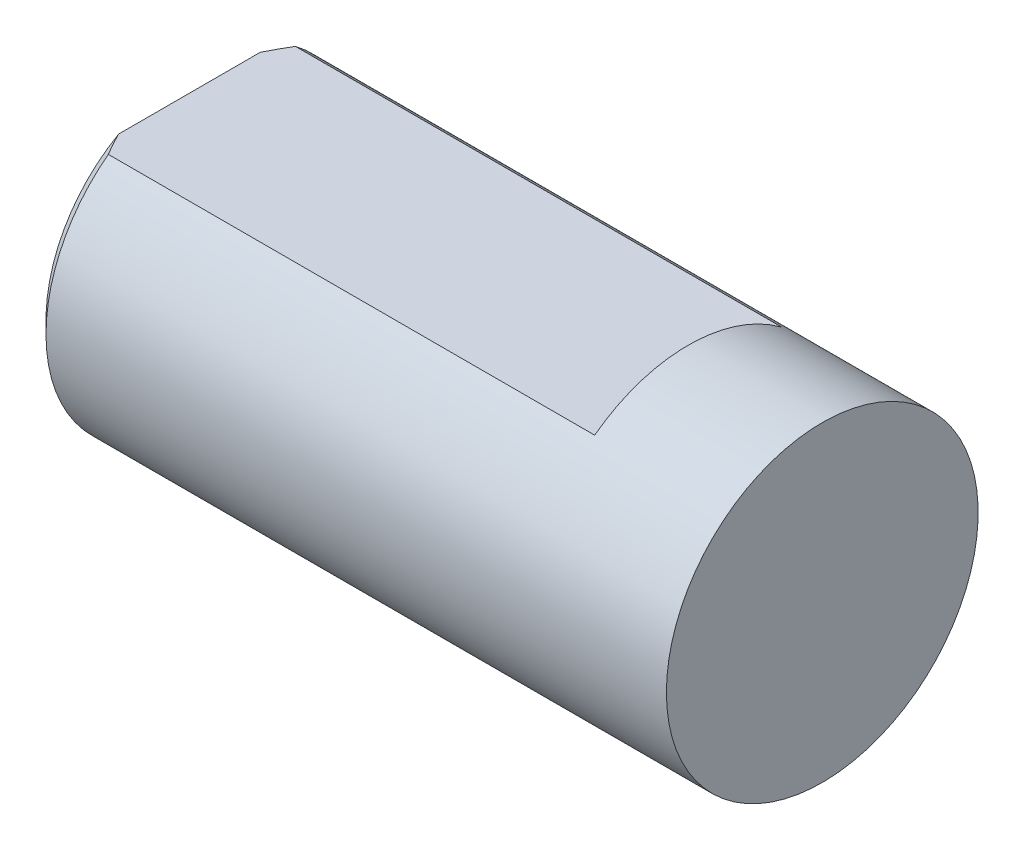
ISO-10303-21;
HEADER;
FILE_DESCRIPTION(('STEP AP214'),'2;1');
FILE_NAME('part.step','',(''),(''),'','','');
FILE_SCHEMA(('AUTOMOTIVE_DESIGN { 1 0 10303 214 1 1 1 1 }'));
ENDSEC;
DATA;
#1=APPLICATION_CONTEXT('core data for automotive mechanical design processes');
#2=APPLICATION_PROTOCOL_DEFINITION('international standard','automotive_design',2000,#1);
#3=PRODUCT_CONTEXT('',#1,'mechanical');
#4=PRODUCT('Part','Part','',(#3));
#5=PRODUCT_RELATED_PRODUCT_CATEGORY('part','',(#4));
#6=PRODUCT_DEFINITION_FORMATION('','',#4);
#7=PRODUCT_DEFINITION_CONTEXT('part definition',#1,'design');
#8=PRODUCT_DEFINITION('design','',#6,#7);
#9=PRODUCT_DEFINITION_SHAPE('','',#8);
#10=(LENGTH_UNIT() NAMED_UNIT(*) SI_UNIT(.MILLI.,.METRE.));
#11=(NAMED_UNIT(*) PLANE_ANGLE_UNIT() SI_UNIT($,.RADIAN.));
#12=(NAMED_UNIT(*) SI_UNIT($,.STERADIAN.) SOLID_ANGLE_UNIT());
#13=UNCERTAINTY_MEASURE_WITH_UNIT(LENGTH_MEASURE(1.E-05),#10,'distance_accuracy_value','');
#14=(GEOMETRIC_REPRESENTATION_CONTEXT(3) GLOBAL_UNCERTAINTY_ASSIGNED_CONTEXT((#13)) GLOBAL_UNIT_ASSIGNED_CONTEXT((#10,
#11,#12)) REPRESENTATION_CONTEXT('',''));
#15=CARTESIAN_POINT('',(0.,0.,0.));
#16=DIRECTION('',(0.,0.,1.));
#17=DIRECTION('',(1.,0.,0.));
#18=AXIS2_PLACEMENT_3D('',#15,#16,#17);
#19=CARTESIAN_POINT('',(0.,0.,0.));
#20=DIRECTION('',(-1.,0.,0.));
#21=DIRECTION('',(0.,0.,1.));
#22=AXIS2_PLACEMENT_3D('',#19,#20,#21);
#23=PLANE('',#22);
#24=CARTESIAN_POINT('',(0.,0.,0.));
#25=DIRECTION('',(-1.,0.,0.));
#26=DIRECTION('',(0.,0.,1.));
#27=AXIS2_PLACEMENT_3D('',#24,#25,#26);
#28=CIRCLE('',#27,2.5);
#29=CARTESIAN_POINT('',(0.,0.,2.5));
#30=VERTEX_POINT('',#29);
#31=EDGE_CURVE('E77',#30,#30,#28,.T.);
#32=ORIENTED_EDGE('',*,*,#31,.F.);
#33=EDGE_LOOP('',(#32));
#34=FACE_BOUND('',#33,.T.);
#35=ADVANCED_FACE('F31',(#34),#23,.F.);
#36=CARTESIAN_POINT('',(0.,0.,0.));
#37=DIRECTION('',(-1.,0.,0.));
#38=DIRECTION('',(0.,0.,1.));
#39=AXIS2_PLACEMENT_3D('',#36,#37,#38);
#40=CYLINDRICAL_SURFACE('',#39,2.5);
#41=DIRECTION('',(-1.,0.,0.));
#42=VECTOR('',#41,1.);
#43=CARTESIAN_POINT('',(-2.15,2.,1.5));
#44=LINE('',#43,#42);
#45=CARTESIAN_POINT('',(-2.15,2.,1.5));
#46=VERTEX_POINT('',#45);
#47=CARTESIAN_POINT('',(-9.95,2.,1.5));
#48=VERTEX_POINT('',#47);
#49=EDGE_CURVE('E66',#46,#48,#44,.T.);
#50=ORIENTED_EDGE('',*,*,#49,.T.);
#51=CARTESIAN_POINT('',(-9.95,0.,0.));
#52=DIRECTION('',(1.,0.,0.));
#53=DIRECTION('',(0.,0.,-1.));
#54=AXIS2_PLACEMENT_3D('',#51,#52,#53);
#55=CIRCLE('',#54,2.5);
#56=CARTESIAN_POINT('',(-9.95,2.,-1.5));
#57=VERTEX_POINT('',#56);
#58=EDGE_CURVE('E11',#48,#57,#55,.T.);
#59=ORIENTED_EDGE('',*,*,#58,.T.);
#60=DIRECTION('',(-1.,0.,0.));
#61=VECTOR('',#60,1.);
#62=CARTESIAN_POINT('',(-2.15,2.,-1.5));
#63=LINE('',#62,#61);
#64=CARTESIAN_POINT('',(-2.15,2.,-1.5));
#65=VERTEX_POINT('',#64);
#66=EDGE_CURVE('E64',#65,#57,#63,.T.);
#67=ORIENTED_EDGE('',*,*,#66,.F.);
#68=CARTESIAN_POINT('',(-2.15,0.,0.));
#69=DIRECTION('',(-1.,0.,0.));
#70=DIRECTION('',(0.,0.,1.));
#71=AXIS2_PLACEMENT_3D('',#68,#69,#70);
#72=CIRCLE('',#71,2.5);
#73=EDGE_CURVE('E69',#46,#65,#72,.T.);
#74=ORIENTED_EDGE('',*,*,#73,.F.);
#75=EDGE_LOOP('',(#50,#59,#67,#74));
#76=FACE_BOUND('',#75,.T.);
#77=ORIENTED_EDGE('',*,*,#31,.T.);
#78=EDGE_LOOP('',(#77));
#79=FACE_BOUND('',#78,.T.);
#80=ADVANCED_FACE('F74',(#76,#79),#40,.T.);
#81=CARTESIAN_POINT('',(-10.15,2.5,0.));
#82=DIRECTION('',(1.,0.,0.));
#83=DIRECTION('',(0.,0.,-1.));
#84=AXIS2_PLACEMENT_3D('',#81,#82,#83);
#85=PLANE('',#84);
#86=DIRECTION('',(0.,0.,1.));
#87=VECTOR('',#86,1.);
#88=CARTESIAN_POINT('',(-10.15,2.,0.));
#89=LINE('',#88,#87);
#90=CARTESIAN_POINT('',(-10.15,2.,-1.13578166916006));
#91=VERTEX_POINT('',#90);
#92=CARTESIAN_POINT('',(-10.15,2.,1.13578166916006));
#93=VERTEX_POINT('',#92);
#94=EDGE_CURVE('E72',#91,#93,#89,.T.);
#95=ORIENTED_EDGE('',*,*,#94,.F.);
#96=CARTESIAN_POINT('',(-10.15,0.,0.));
#97=DIRECTION('',(1.,0.,0.));
#98=DIRECTION('',(0.,0.,-1.));
#99=AXIS2_PLACEMENT_3D('',#96,#97,#98);
#100=CIRCLE('',#99,2.3);
#101=EDGE_CURVE('E82',#91,#93,#100,.F.);
#102=ORIENTED_EDGE('',*,*,#101,.T.);
#103=EDGE_LOOP('',(#95,#102));
#104=FACE_BOUND('',#103,.T.);
#105=ADVANCED_FACE('F100',(#104),#85,.F.);
#106=CARTESIAN_POINT('',(-2.15,2.,0.));
#107=DIRECTION('',(0.,-1.,0.));
#108=DIRECTION('',(0.,0.,-1.));
#109=AXIS2_PLACEMENT_3D('',#106,#107,#108);
#110=PLANE('',#109);
#111=ORIENTED_EDGE('',*,*,#94,.T.);
#112=CARTESIAN_POINT('',(-10.15,2.,1.13578166916006));
#113=CARTESIAN_POINT('',(-10.1346588897814,2.,1.16684531148886));
#114=CARTESIAN_POINT('',(-10.1189381376528,2.,1.19771947914308));
#115=CARTESIAN_POINT('',(-10.0868162971825,2.,1.25909582358931));
#116=CARTESIAN_POINT('',(-10.070415494086,2.,1.28959814953928));
#117=CARTESIAN_POINT('',(-10.0370005487157,2.,1.35026188212942));
#118=CARTESIAN_POINT('',(-10.0199864399502,2.,1.380423307277));
#119=CARTESIAN_POINT('',(-9.98539731601963,2.,1.44043971345171));
#120=CARTESIAN_POINT('',(-9.96782207083391,2.,1.47029456200406));
#121=CARTESIAN_POINT('',(-9.95,2.,1.5));
#122=B_SPLINE_CURVE_WITH_KNOTS('',3,(#112,#113,#114,#115,#116,#117,#118,#119,#120,#121),
.UNSPECIFIED.,.F.,.F.,(4,2,2,2,4),(0.,0.103930863284102,0.207818565532301,0.311700600383635,
0.415625779466399),.UNSPECIFIED.);
#123=EDGE_CURVE('E38',#93,#48,#122,.T.);
#124=ORIENTED_EDGE('',*,*,#123,.T.);
#125=ORIENTED_EDGE('',*,*,#49,.F.);
#126=DIRECTION('',(0.,0.,1.));
#127=VECTOR('',#126,1.);
#128=CARTESIAN_POINT('',(-2.15,2.,-1.5));
#129=LINE('',#128,#127);
#130=EDGE_CURVE('E61',#65,#46,#129,.T.);
#131=ORIENTED_EDGE('',*,*,#130,.F.);
#132=ORIENTED_EDGE('',*,*,#66,.T.);
#133=CARTESIAN_POINT('',(-9.95,2.,-1.5));
#134=CARTESIAN_POINT('',(-9.96782207083391,2.,-1.47029456200406));
#135=CARTESIAN_POINT('',(-9.98539731601963,2.,-1.44043971345171));
#136=CARTESIAN_POINT('',(-10.0199864399502,2.,-1.380423307277));
#137=CARTESIAN_POINT('',(-10.0370005487157,2.,-1.35026188212942));
#138=CARTESIAN_POINT('',(-10.070415494086,2.,-1.28959814953928));
#139=CARTESIAN_POINT('',(-10.0868162971825,2.,-1.25909582358931));
#140=CARTESIAN_POINT('',(-10.1189381376528,2.,-1.19771947914308));
#141=CARTESIAN_POINT('',(-10.1346588897814,2.,-1.16684531148886));
#142=CARTESIAN_POINT('',(-10.15,2.,-1.13578166916006));
#143=B_SPLINE_CURVE_WITH_KNOTS('',3,(#133,#134,#135,#136,#137,#138,#139,#140,#141,#142),
.UNSPECIFIED.,.F.,.F.,(4,2,2,2,4),(0.,0.103925179082765,0.207807213934099,0.311694916182298,
0.4156257794664),.UNSPECIFIED.);
#144=EDGE_CURVE('E85',#57,#91,#143,.T.);
#145=ORIENTED_EDGE('',*,*,#144,.T.);
#146=EDGE_LOOP('',(#111,#124,#125,#131,#132,#145));
#147=FACE_BOUND('',#146,.T.);
#148=ADVANCED_FACE('F63',(#147),#110,.F.);
#149=CARTESIAN_POINT('',(-2.15,0.,0.));
#150=DIRECTION('',(-1.,0.,0.));
#151=DIRECTION('',(0.,0.,1.));
#152=AXIS2_PLACEMENT_3D('',#149,#150,#151);
#153=PLANE('',#152);
#154=ORIENTED_EDGE('',*,*,#73,.T.);
#155=ORIENTED_EDGE('',*,*,#130,.T.);
#156=EDGE_LOOP('',(#154,#155));
#157=FACE_BOUND('',#156,.T.);
#158=ADVANCED_FACE('F71',(#157),#153,.T.);
#159=CARTESIAN_POINT('',(-10.15,0.,0.));
#160=DIRECTION('',(1.,0.,0.));
#161=DIRECTION('',(0.,0.,-1.));
#162=AXIS2_PLACEMENT_3D('',#159,#160,#161);
#163=CONICAL_SURFACE('',#162,2.3,0.785398163397442);
#164=ORIENTED_EDGE('',*,*,#144,.F.);
#165=ORIENTED_EDGE('',*,*,#58,.F.);
#166=ORIENTED_EDGE('',*,*,#123,.F.);
#167=ORIENTED_EDGE('',*,*,#101,.F.);
#168=EDGE_LOOP('',(#164,#165,#166,#167));
#169=FACE_BOUND('',#168,.T.);
#170=ADVANCED_FACE('F94',(#169),#163,.T.);
#171=CLOSED_SHELL('',(#35,#80,#105,#148,#158,#170));
#172=MANIFOLD_SOLID_BREP('B2',#171);
#173=ADVANCED_BREP_SHAPE_REPRESENTATION('',(#18,#172),#14);
#174=SHAPE_DEFINITION_REPRESENTATION(#9,#173);
ENDSEC;
END-ISO-10303-21;
